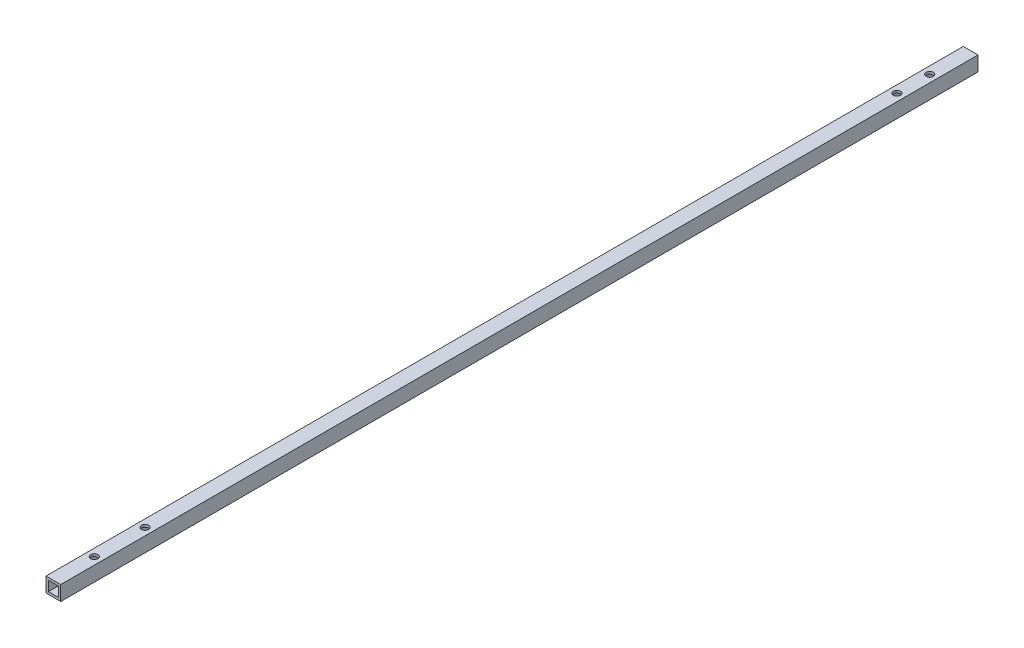
ISO-10303-21;
HEADER;
FILE_DESCRIPTION(('STEP AP214'),'2;1');
FILE_NAME('part.step','',(''),(''),'','','');
FILE_SCHEMA(('AUTOMOTIVE_DESIGN { 1 0 10303 214 1 1 1 1 }'));
ENDSEC;
DATA;
#1=APPLICATION_CONTEXT('core data for automotive mechanical design processes');
#2=APPLICATION_PROTOCOL_DEFINITION('international standard','automotive_design',2000,#1);
#3=PRODUCT_CONTEXT('',#1,'mechanical');
#4=PRODUCT('Part','Part','',(#3));
#5=PRODUCT_RELATED_PRODUCT_CATEGORY('part','',(#4));
#6=PRODUCT_DEFINITION_FORMATION('','',#4);
#7=PRODUCT_DEFINITION_CONTEXT('part definition',#1,'design');
#8=PRODUCT_DEFINITION('design','',#6,#7);
#9=PRODUCT_DEFINITION_SHAPE('','',#8);
#10=(LENGTH_UNIT() NAMED_UNIT(*) SI_UNIT(.MILLI.,.METRE.));
#11=(NAMED_UNIT(*) PLANE_ANGLE_UNIT() SI_UNIT($,.RADIAN.));
#12=(NAMED_UNIT(*) SI_UNIT($,.STERADIAN.) SOLID_ANGLE_UNIT());
#13=UNCERTAINTY_MEASURE_WITH_UNIT(LENGTH_MEASURE(1.E-05),#10,'distance_accuracy_value','');
#14=(GEOMETRIC_REPRESENTATION_CONTEXT(3) GLOBAL_UNCERTAINTY_ASSIGNED_CONTEXT((#13)) GLOBAL_UNIT_ASSIGNED_CONTEXT((#10,
#11,#12)) REPRESENTATION_CONTEXT('',''));
#15=CARTESIAN_POINT('',(0.,0.,0.));
#16=DIRECTION('',(0.,0.,1.));
#17=DIRECTION('',(1.,0.,0.));
#18=AXIS2_PLACEMENT_3D('',#15,#16,#17);
#19=CARTESIAN_POINT('',(4.5,4.5,560.3));
#20=DIRECTION('',(-1.,0.,0.));
#21=DIRECTION('',(0.,-1.,0.));
#22=AXIS2_PLACEMENT_3D('',#19,#20,#21);
#23=PLANE('',#22);
#24=DIRECTION('',(0.,1.,0.));
#25=VECTOR('',#24,1.);
#26=CARTESIAN_POINT('',(4.5,4.5,0.));
#27=LINE('',#26,#25);
#28=CARTESIAN_POINT('',(4.5,-4.5,0.));
#29=VERTEX_POINT('',#28);
#30=CARTESIAN_POINT('',(4.5,4.5,0.));
#31=VERTEX_POINT('',#30);
#32=EDGE_CURVE('E136',#29,#31,#27,.T.);
#33=ORIENTED_EDGE('',*,*,#32,.T.);
#34=DIRECTION('',(0.,0.,-1.));
#35=VECTOR('',#34,1.);
#36=CARTESIAN_POINT('',(4.5,4.5,560.3));
#37=LINE('',#36,#35);
#38=CARTESIAN_POINT('',(4.5,4.5,560.3));
#39=VERTEX_POINT('',#38);
#40=EDGE_CURVE('E12',#39,#31,#37,.T.);
#41=ORIENTED_EDGE('',*,*,#40,.F.);
#42=DIRECTION('',(0.,1.,0.));
#43=VECTOR('',#42,1.);
#44=CARTESIAN_POINT('',(4.5,4.5,560.3));
#45=LINE('',#44,#43);
#46=CARTESIAN_POINT('',(4.5,-4.5,560.3));
#47=VERTEX_POINT('',#46);
#48=EDGE_CURVE('E140',#47,#39,#45,.T.);
#49=ORIENTED_EDGE('',*,*,#48,.F.);
#50=DIRECTION('',(0.,0.,-1.));
#51=VECTOR('',#50,1.);
#52=CARTESIAN_POINT('',(4.5,-4.5,560.3));
#53=LINE('',#52,#51);
#54=EDGE_CURVE('E150',#47,#29,#53,.T.);
#55=ORIENTED_EDGE('',*,*,#54,.T.);
#56=EDGE_LOOP('',(#33,#41,#49,#55));
#57=FACE_BOUND('',#56,.T.);
#58=ADVANCED_FACE('F34',(#57),#23,.F.);
#59=CARTESIAN_POINT('',(-4.5,4.5,560.3));
#60=DIRECTION('',(0.,-1.,0.));
#61=DIRECTION('',(0.,0.,-1.));
#62=AXIS2_PLACEMENT_3D('',#59,#60,#61);
#63=PLANE('',#62);
#64=CARTESIAN_POINT('',(0.,4.5,504.3));
#65=DIRECTION('',(0.,1.,0.));
#66=DIRECTION('',(0.,0.,1.));
#67=AXIS2_PLACEMENT_3D('',#64,#65,#66);
#68=CIRCLE('',#67,2.19999999999996);
#69=CARTESIAN_POINT('',(0.,4.5,506.5));
#70=VERTEX_POINT('',#69);
#71=EDGE_CURVE('E177',#70,#70,#68,.T.);
#72=ORIENTED_EDGE('',*,*,#71,.F.);
#73=EDGE_LOOP('',(#72));
#74=FACE_BOUND('',#73,.T.);
#75=CARTESIAN_POINT('',(0.,4.5,535.3));
#76=DIRECTION('',(0.,1.,0.));
#77=DIRECTION('',(0.,0.,1.));
#78=AXIS2_PLACEMENT_3D('',#75,#76,#77);
#79=CIRCLE('',#78,2.19999999999996);
#80=CARTESIAN_POINT('',(0.,4.5,537.5));
#81=VERTEX_POINT('',#80);
#82=EDGE_CURVE('E184',#81,#81,#79,.T.);
#83=ORIENTED_EDGE('',*,*,#82,.F.);
#84=EDGE_LOOP('',(#83));
#85=FACE_BOUND('',#84,.T.);
#86=CARTESIAN_POINT('',(0.,4.5,25.));
#87=DIRECTION('',(0.,1.,0.));
#88=DIRECTION('',(0.,0.,1.));
#89=AXIS2_PLACEMENT_3D('',#86,#87,#88);
#90=CIRCLE('',#89,2.2);
#91=CARTESIAN_POINT('',(0.,4.5,27.2));
#92=VERTEX_POINT('',#91);
#93=EDGE_CURVE('E169',#92,#92,#90,.T.);
#94=ORIENTED_EDGE('',*,*,#93,.F.);
#95=EDGE_LOOP('',(#94));
#96=FACE_BOUND('',#95,.T.);
#97=CARTESIAN_POINT('',(0.,4.5,45.));
#98=DIRECTION('',(0.,1.,0.));
#99=DIRECTION('',(0.,0.,1.));
#100=AXIS2_PLACEMENT_3D('',#97,#98,#99);
#101=CIRCLE('',#100,2.2);
#102=CARTESIAN_POINT('',(0.,4.5,47.2));
#103=VERTEX_POINT('',#102);
#104=EDGE_CURVE('E199',#103,#103,#101,.T.);
#105=ORIENTED_EDGE('',*,*,#104,.F.);
#106=EDGE_LOOP('',(#105));
#107=FACE_BOUND('',#106,.T.);
#108=DIRECTION('',(-1.,0.,0.));
#109=VECTOR('',#108,1.);
#110=CARTESIAN_POINT('',(-4.5,4.5,0.));
#111=LINE('',#110,#109);
#112=CARTESIAN_POINT('',(-4.5,4.5,0.));
#113=VERTEX_POINT('',#112);
#114=EDGE_CURVE('E153',#31,#113,#111,.T.);
#115=ORIENTED_EDGE('',*,*,#114,.T.);
#116=DIRECTION('',(0.,0.,-1.));
#117=VECTOR('',#116,1.);
#118=CARTESIAN_POINT('',(-4.5,4.5,560.3));
#119=LINE('',#118,#117);
#120=CARTESIAN_POINT('',(-4.5,4.5,560.3));
#121=VERTEX_POINT('',#120);
#122=EDGE_CURVE('E42',#121,#113,#119,.T.);
#123=ORIENTED_EDGE('',*,*,#122,.F.);
#124=DIRECTION('',(-1.,0.,0.));
#125=VECTOR('',#124,1.);
#126=CARTESIAN_POINT('',(-4.5,4.5,560.3));
#127=LINE('',#126,#125);
#128=EDGE_CURVE('E143',#39,#121,#127,.T.);
#129=ORIENTED_EDGE('',*,*,#128,.F.);
#130=ORIENTED_EDGE('',*,*,#40,.T.);
#131=EDGE_LOOP('',(#115,#123,#129,#130));
#132=FACE_BOUND('',#131,.T.);
#133=ADVANCED_FACE('F237',(#74,#85,#96,#107,#132),#63,.F.);
#134=CARTESIAN_POINT('',(-4.5,4.5,560.3));
#135=DIRECTION('',(1.,0.,0.));
#136=DIRECTION('',(0.,1.,0.));
#137=AXIS2_PLACEMENT_3D('',#134,#135,#136);
#138=PLANE('',#137);
#139=DIRECTION('',(0.,-1.,0.));
#140=VECTOR('',#139,1.);
#141=CARTESIAN_POINT('',(-4.5,4.5,0.));
#142=LINE('',#141,#140);
#143=CARTESIAN_POINT('',(-4.5,-4.5,0.));
#144=VERTEX_POINT('',#143);
#145=EDGE_CURVE('E155',#113,#144,#142,.T.);
#146=ORIENTED_EDGE('',*,*,#145,.T.);
#147=DIRECTION('',(0.,0.,-1.));
#148=VECTOR('',#147,1.);
#149=CARTESIAN_POINT('',(-4.5,-4.5,560.3));
#150=LINE('',#149,#148);
#151=CARTESIAN_POINT('',(-4.5,-4.5,560.3));
#152=VERTEX_POINT('',#151);
#153=EDGE_CURVE('E160',#152,#144,#150,.T.);
#154=ORIENTED_EDGE('',*,*,#153,.F.);
#155=DIRECTION('',(0.,-1.,0.));
#156=VECTOR('',#155,1.);
#157=CARTESIAN_POINT('',(-4.5,4.5,560.3));
#158=LINE('',#157,#156);
#159=EDGE_CURVE('E146',#121,#152,#158,.T.);
#160=ORIENTED_EDGE('',*,*,#159,.F.);
#161=ORIENTED_EDGE('',*,*,#122,.T.);
#162=EDGE_LOOP('',(#146,#154,#160,#161));
#163=FACE_BOUND('',#162,.T.);
#164=ADVANCED_FACE('F242',(#163),#138,.F.);
#165=CARTESIAN_POINT('',(-4.5,-4.5,560.3));
#166=DIRECTION('',(0.,1.,0.));
#167=DIRECTION('',(0.,0.,1.));
#168=AXIS2_PLACEMENT_3D('',#165,#166,#167);
#169=PLANE('',#168);
#170=CARTESIAN_POINT('',(0.,-4.5,504.3));
#171=DIRECTION('',(0.,1.,0.));
#172=DIRECTION('',(0.,0.,1.));
#173=AXIS2_PLACEMENT_3D('',#170,#171,#172);
#174=CIRCLE('',#173,2.19999999999996);
#175=CARTESIAN_POINT('',(0.,-4.5,506.5));
#176=VERTEX_POINT('',#175);
#177=EDGE_CURVE('E196',#176,#176,#174,.T.);
#178=ORIENTED_EDGE('',*,*,#177,.T.);
#179=EDGE_LOOP('',(#178));
#180=FACE_BOUND('',#179,.T.);
#181=CARTESIAN_POINT('',(0.,-4.5,535.3));
#182=DIRECTION('',(0.,1.,0.));
#183=DIRECTION('',(0.,0.,1.));
#184=AXIS2_PLACEMENT_3D('',#181,#182,#183);
#185=CIRCLE('',#184,2.19999999999996);
#186=CARTESIAN_POINT('',(0.,-4.5,537.5));
#187=VERTEX_POINT('',#186);
#188=EDGE_CURVE('E181',#187,#187,#185,.T.);
#189=ORIENTED_EDGE('',*,*,#188,.T.);
#190=EDGE_LOOP('',(#189));
#191=FACE_BOUND('',#190,.T.);
#192=CARTESIAN_POINT('',(0.,-4.49999999999995,25.));
#193=DIRECTION('',(0.,1.,0.));
#194=DIRECTION('',(0.,0.,1.));
#195=AXIS2_PLACEMENT_3D('',#192,#193,#194);
#196=CIRCLE('',#195,2.2);
#197=CARTESIAN_POINT('',(0.,-4.49999999999995,27.2));
#198=VERTEX_POINT('',#197);
#199=EDGE_CURVE('E124',#198,#198,#196,.T.);
#200=ORIENTED_EDGE('',*,*,#199,.T.);
#201=EDGE_LOOP('',(#200));
#202=FACE_BOUND('',#201,.T.);
#203=CARTESIAN_POINT('',(0.,-4.49999999999995,45.));
#204=DIRECTION('',(0.,1.,0.));
#205=DIRECTION('',(0.,0.,1.));
#206=AXIS2_PLACEMENT_3D('',#203,#204,#205);
#207=CIRCLE('',#206,2.2);
#208=CARTESIAN_POINT('',(0.,-4.49999999999995,47.2));
#209=VERTEX_POINT('',#208);
#210=EDGE_CURVE('E173',#209,#209,#207,.T.);
#211=ORIENTED_EDGE('',*,*,#210,.T.);
#212=EDGE_LOOP('',(#211));
#213=FACE_BOUND('',#212,.T.);
#214=DIRECTION('',(1.,0.,0.));
#215=VECTOR('',#214,1.);
#216=CARTESIAN_POINT('',(-4.5,-4.5,0.));
#217=LINE('',#216,#215);
#218=EDGE_CURVE('E144',#144,#29,#217,.T.);
#219=ORIENTED_EDGE('',*,*,#218,.T.);
#220=ORIENTED_EDGE('',*,*,#54,.F.);
#221=DIRECTION('',(1.,0.,0.));
#222=VECTOR('',#221,1.);
#223=CARTESIAN_POINT('',(-4.5,-4.5,560.3));
#224=LINE('',#223,#222);
#225=EDGE_CURVE('E148',#152,#47,#224,.T.);
#226=ORIENTED_EDGE('',*,*,#225,.F.);
#227=ORIENTED_EDGE('',*,*,#153,.T.);
#228=EDGE_LOOP('',(#219,#220,#226,#227));
#229=FACE_BOUND('',#228,.T.);
#230=ADVANCED_FACE('F213',(#180,#191,#202,#213,#229),#169,.F.);
#231=CARTESIAN_POINT('',(0.,0.,560.3));
#232=DIRECTION('',(0.,0.,1.));
#233=DIRECTION('',(1.,0.,0.));
#234=AXIS2_PLACEMENT_3D('',#231,#232,#233);
#235=PLANE('',#234);
#236=DIRECTION('',(0.,1.,0.));
#237=VECTOR('',#236,1.);
#238=CARTESIAN_POINT('',(3.,3.,560.3));
#239=LINE('',#238,#237);
#240=CARTESIAN_POINT('',(3.,-3.,560.3));
#241=VERTEX_POINT('',#240);
#242=CARTESIAN_POINT('',(3.,3.,560.3));
#243=VERTEX_POINT('',#242);
#244=EDGE_CURVE('E50',#241,#243,#239,.T.);
#245=ORIENTED_EDGE('',*,*,#244,.F.);
#246=DIRECTION('',(1.,0.,0.));
#247=VECTOR('',#246,1.);
#248=CARTESIAN_POINT('',(-3.,-3.,560.3));
#249=LINE('',#248,#247);
#250=CARTESIAN_POINT('',(-3.,-3.,560.3));
#251=VERTEX_POINT('',#250);
#252=EDGE_CURVE('E118',#251,#241,#249,.T.);
#253=ORIENTED_EDGE('',*,*,#252,.F.);
#254=DIRECTION('',(0.,-1.,0.));
#255=VECTOR('',#254,1.);
#256=CARTESIAN_POINT('',(-3.,3.,560.3));
#257=LINE('',#256,#255);
#258=CARTESIAN_POINT('',(-3.,3.,560.3));
#259=VERTEX_POINT('',#258);
#260=EDGE_CURVE('E121',#259,#251,#257,.T.);
#261=ORIENTED_EDGE('',*,*,#260,.F.);
#262=DIRECTION('',(-1.,0.,0.));
#263=VECTOR('',#262,1.);
#264=CARTESIAN_POINT('',(-3.,3.,560.3));
#265=LINE('',#264,#263);
#266=EDGE_CURVE('E130',#243,#259,#265,.T.);
#267=ORIENTED_EDGE('',*,*,#266,.F.);
#268=EDGE_LOOP('',(#245,#253,#261,#267));
#269=FACE_BOUND('',#268,.T.);
#270=ORIENTED_EDGE('',*,*,#48,.T.);
#271=ORIENTED_EDGE('',*,*,#128,.T.);
#272=ORIENTED_EDGE('',*,*,#159,.T.);
#273=ORIENTED_EDGE('',*,*,#225,.T.);
#274=EDGE_LOOP('',(#270,#271,#272,#273));
#275=FACE_BOUND('',#274,.T.);
#276=ADVANCED_FACE('F254',(#269,#275),#235,.T.);
#277=CARTESIAN_POINT('',(0.,0.,0.));
#278=DIRECTION('',(0.,0.,1.));
#279=DIRECTION('',(1.,0.,0.));
#280=AXIS2_PLACEMENT_3D('',#277,#278,#279);
#281=PLANE('',#280);
#282=DIRECTION('',(1.,0.,0.));
#283=VECTOR('',#282,1.);
#284=CARTESIAN_POINT('',(-3.,-3.,0.));
#285=LINE('',#284,#283);
#286=CARTESIAN_POINT('',(-3.,-3.,0.));
#287=VERTEX_POINT('',#286);
#288=CARTESIAN_POINT('',(3.,-3.,0.));
#289=VERTEX_POINT('',#288);
#290=EDGE_CURVE('E108',#287,#289,#285,.T.);
#291=ORIENTED_EDGE('',*,*,#290,.T.);
#292=DIRECTION('',(0.,1.,0.));
#293=VECTOR('',#292,1.);
#294=CARTESIAN_POINT('',(3.,3.,0.));
#295=LINE('',#294,#293);
#296=CARTESIAN_POINT('',(3.,3.,0.));
#297=VERTEX_POINT('',#296);
#298=EDGE_CURVE('E102',#289,#297,#295,.T.);
#299=ORIENTED_EDGE('',*,*,#298,.T.);
#300=DIRECTION('',(-1.,0.,0.));
#301=VECTOR('',#300,1.);
#302=CARTESIAN_POINT('',(-3.,3.,0.));
#303=LINE('',#302,#301);
#304=CARTESIAN_POINT('',(-3.,3.,0.));
#305=VERTEX_POINT('',#304);
#306=EDGE_CURVE('E111',#297,#305,#303,.T.);
#307=ORIENTED_EDGE('',*,*,#306,.T.);
#308=DIRECTION('',(0.,-1.,0.));
#309=VECTOR('',#308,1.);
#310=CARTESIAN_POINT('',(-3.,3.,0.));
#311=LINE('',#310,#309);
#312=EDGE_CURVE('E58',#305,#287,#311,.T.);
#313=ORIENTED_EDGE('',*,*,#312,.T.);
#314=EDGE_LOOP('',(#291,#299,#307,#313));
#315=FACE_BOUND('',#314,.T.);
#316=ORIENTED_EDGE('',*,*,#32,.F.);
#317=ORIENTED_EDGE('',*,*,#218,.F.);
#318=ORIENTED_EDGE('',*,*,#145,.F.);
#319=ORIENTED_EDGE('',*,*,#114,.F.);
#320=EDGE_LOOP('',(#316,#317,#318,#319));
#321=FACE_BOUND('',#320,.T.);
#322=ADVANCED_FACE('F115',(#315,#321),#281,.F.);
#323=CARTESIAN_POINT('',(3.,3.,0.));
#324=DIRECTION('',(1.,0.,0.));
#325=DIRECTION('',(0.,1.,0.));
#326=AXIS2_PLACEMENT_3D('',#323,#324,#325);
#327=PLANE('',#326);
#328=ORIENTED_EDGE('',*,*,#244,.T.);
#329=DIRECTION('',(0.,0.,1.));
#330=VECTOR('',#329,1.);
#331=CARTESIAN_POINT('',(3.,3.,0.));
#332=LINE('',#331,#330);
#333=EDGE_CURVE('E98',#297,#243,#332,.T.);
#334=ORIENTED_EDGE('',*,*,#333,.F.);
#335=ORIENTED_EDGE('',*,*,#298,.F.);
#336=DIRECTION('',(0.,0.,1.));
#337=VECTOR('',#336,1.);
#338=CARTESIAN_POINT('',(3.,-3.,0.));
#339=LINE('',#338,#337);
#340=EDGE_CURVE('E134',#289,#241,#339,.T.);
#341=ORIENTED_EDGE('',*,*,#340,.T.);
#342=EDGE_LOOP('',(#328,#334,#335,#341));
#343=FACE_BOUND('',#342,.T.);
#344=ADVANCED_FACE('F100',(#343),#327,.F.);
#345=CARTESIAN_POINT('',(-3.,-3.,0.));
#346=DIRECTION('',(0.,-1.,0.));
#347=DIRECTION('',(0.,0.,-1.));
#348=AXIS2_PLACEMENT_3D('',#345,#346,#347);
#349=PLANE('',#348);
#350=CARTESIAN_POINT('',(0.,-3.,504.3));
#351=DIRECTION('',(0.,-1.,0.));
#352=DIRECTION('',(0.,0.,-1.));
#353=AXIS2_PLACEMENT_3D('',#350,#351,#352);
#354=CIRCLE('',#353,2.19999999999996);
#355=CARTESIAN_POINT('',(0.,-3.,502.1));
#356=VERTEX_POINT('',#355);
#357=EDGE_CURVE('E193',#356,#356,#354,.T.);
#358=ORIENTED_EDGE('',*,*,#357,.T.);
#359=EDGE_LOOP('',(#358));
#360=FACE_BOUND('',#359,.T.);
#361=CARTESIAN_POINT('',(0.,-3.,535.3));
#362=DIRECTION('',(0.,-1.,0.));
#363=DIRECTION('',(0.,0.,-1.));
#364=AXIS2_PLACEMENT_3D('',#361,#362,#363);
#365=CIRCLE('',#364,2.19999999999996);
#366=CARTESIAN_POINT('',(0.,-3.,533.1));
#367=VERTEX_POINT('',#366);
#368=EDGE_CURVE('E176',#367,#367,#365,.T.);
#369=ORIENTED_EDGE('',*,*,#368,.T.);
#370=EDGE_LOOP('',(#369));
#371=FACE_BOUND('',#370,.T.);
#372=CARTESIAN_POINT('',(0.,-3.,25.));
#373=DIRECTION('',(0.,-1.,0.));
#374=DIRECTION('',(0.,0.,-1.));
#375=AXIS2_PLACEMENT_3D('',#372,#373,#374);
#376=CIRCLE('',#375,2.2);
#377=CARTESIAN_POINT('',(0.,-3.,22.8));
#378=VERTEX_POINT('',#377);
#379=EDGE_CURVE('E172',#378,#378,#376,.T.);
#380=ORIENTED_EDGE('',*,*,#379,.T.);
#381=EDGE_LOOP('',(#380));
#382=FACE_BOUND('',#381,.T.);
#383=CARTESIAN_POINT('',(0.,-3.,45.));
#384=DIRECTION('',(0.,-1.,0.));
#385=DIRECTION('',(0.,0.,-1.));
#386=AXIS2_PLACEMENT_3D('',#383,#384,#385);
#387=CIRCLE('',#386,2.2);
#388=CARTESIAN_POINT('',(0.,-3.,42.8));
#389=VERTEX_POINT('',#388);
#390=EDGE_CURVE('E168',#389,#389,#387,.T.);
#391=ORIENTED_EDGE('',*,*,#390,.T.);
#392=EDGE_LOOP('',(#391));
#393=FACE_BOUND('',#392,.T.);
#394=ORIENTED_EDGE('',*,*,#252,.T.);
#395=ORIENTED_EDGE('',*,*,#340,.F.);
#396=ORIENTED_EDGE('',*,*,#290,.F.);
#397=DIRECTION('',(0.,0.,1.));
#398=VECTOR('',#397,1.);
#399=CARTESIAN_POINT('',(-3.,-3.,0.));
#400=LINE('',#399,#398);
#401=EDGE_CURVE('E137',#287,#251,#400,.T.);
#402=ORIENTED_EDGE('',*,*,#401,.T.);
#403=EDGE_LOOP('',(#394,#395,#396,#402));
#404=FACE_BOUND('',#403,.T.);
#405=ADVANCED_FACE('F274',(#360,#371,#382,#393,#404),#349,.F.);
#406=CARTESIAN_POINT('',(-3.,3.,0.));
#407=DIRECTION('',(-1.,0.,0.));
#408=DIRECTION('',(0.,-1.,0.));
#409=AXIS2_PLACEMENT_3D('',#406,#407,#408);
#410=PLANE('',#409);
#411=ORIENTED_EDGE('',*,*,#260,.T.);
#412=ORIENTED_EDGE('',*,*,#401,.F.);
#413=ORIENTED_EDGE('',*,*,#312,.F.);
#414=DIRECTION('',(0.,0.,1.));
#415=VECTOR('',#414,1.);
#416=CARTESIAN_POINT('',(-3.,3.,0.));
#417=LINE('',#416,#415);
#418=EDGE_CURVE('E107',#305,#259,#417,.T.);
#419=ORIENTED_EDGE('',*,*,#418,.T.);
#420=EDGE_LOOP('',(#411,#412,#413,#419));
#421=FACE_BOUND('',#420,.T.);
#422=ADVANCED_FACE('F277',(#421),#410,.F.);
#423=CARTESIAN_POINT('',(-3.,3.,0.));
#424=DIRECTION('',(0.,1.,0.));
#425=DIRECTION('',(0.,0.,1.));
#426=AXIS2_PLACEMENT_3D('',#423,#424,#425);
#427=PLANE('',#426);
#428=CARTESIAN_POINT('',(0.,3.,504.3));
#429=DIRECTION('',(0.,1.,0.));
#430=DIRECTION('',(0.,0.,1.));
#431=AXIS2_PLACEMENT_3D('',#428,#429,#430);
#432=CIRCLE('',#431,2.19999999999996);
#433=CARTESIAN_POINT('',(0.,3.,506.5));
#434=VERTEX_POINT('',#433);
#435=EDGE_CURVE('E37',#434,#434,#432,.T.);
#436=ORIENTED_EDGE('',*,*,#435,.T.);
#437=EDGE_LOOP('',(#436));
#438=FACE_BOUND('',#437,.T.);
#439=CARTESIAN_POINT('',(0.,3.,535.3));
#440=DIRECTION('',(0.,1.,0.));
#441=DIRECTION('',(0.,0.,1.));
#442=AXIS2_PLACEMENT_3D('',#439,#440,#441);
#443=CIRCLE('',#442,2.19999999999996);
#444=CARTESIAN_POINT('',(0.,3.,537.5));
#445=VERTEX_POINT('',#444);
#446=EDGE_CURVE('E174',#445,#445,#443,.T.);
#447=ORIENTED_EDGE('',*,*,#446,.T.);
#448=EDGE_LOOP('',(#447));
#449=FACE_BOUND('',#448,.T.);
#450=CARTESIAN_POINT('',(0.,3.,25.));
#451=DIRECTION('',(0.,1.,0.));
#452=DIRECTION('',(0.,0.,1.));
#453=AXIS2_PLACEMENT_3D('',#450,#451,#452);
#454=CIRCLE('',#453,2.2);
#455=CARTESIAN_POINT('',(0.,3.,27.2));
#456=VERTEX_POINT('',#455);
#457=EDGE_CURVE('E170',#456,#456,#454,.T.);
#458=ORIENTED_EDGE('',*,*,#457,.T.);
#459=EDGE_LOOP('',(#458));
#460=FACE_BOUND('',#459,.T.);
#461=CARTESIAN_POINT('',(0.,3.,45.));
#462=DIRECTION('',(0.,1.,0.));
#463=DIRECTION('',(0.,0.,1.));
#464=AXIS2_PLACEMENT_3D('',#461,#462,#463);
#465=CIRCLE('',#464,2.2);
#466=CARTESIAN_POINT('',(0.,3.,47.2));
#467=VERTEX_POINT('',#466);
#468=EDGE_CURVE('E165',#467,#467,#465,.T.);
#469=ORIENTED_EDGE('',*,*,#468,.T.);
#470=EDGE_LOOP('',(#469));
#471=FACE_BOUND('',#470,.T.);
#472=ORIENTED_EDGE('',*,*,#266,.T.);
#473=ORIENTED_EDGE('',*,*,#418,.F.);
#474=ORIENTED_EDGE('',*,*,#306,.F.);
#475=ORIENTED_EDGE('',*,*,#333,.T.);
#476=EDGE_LOOP('',(#472,#473,#474,#475));
#477=FACE_BOUND('',#476,.T.);
#478=ADVANCED_FACE('F112',(#438,#449,#460,#471,#477),#427,.F.);
#479=CARTESIAN_POINT('',(0.,-577.5,45.));
#480=DIRECTION('',(0.,1.,0.));
#481=DIRECTION('',(0.,0.,1.));
#482=AXIS2_PLACEMENT_3D('',#479,#480,#481);
#483=CYLINDRICAL_SURFACE('',#482,2.2);
#484=ORIENTED_EDGE('',*,*,#104,.T.);
#485=EDGE_LOOP('',(#484));
#486=FACE_BOUND('',#485,.T.);
#487=ORIENTED_EDGE('',*,*,#468,.F.);
#488=EDGE_LOOP('',(#487));
#489=FACE_BOUND('',#488,.T.);
#490=ADVANCED_FACE('F233',(#486,#489),#483,.F.);
#491=CARTESIAN_POINT('',(0.,-577.5,25.));
#492=DIRECTION('',(0.,1.,0.));
#493=DIRECTION('',(0.,0.,1.));
#494=AXIS2_PLACEMENT_3D('',#491,#492,#493);
#495=CYLINDRICAL_SURFACE('',#494,2.2);
#496=ORIENTED_EDGE('',*,*,#93,.T.);
#497=EDGE_LOOP('',(#496));
#498=FACE_BOUND('',#497,.T.);
#499=ORIENTED_EDGE('',*,*,#457,.F.);
#500=EDGE_LOOP('',(#499));
#501=FACE_BOUND('',#500,.T.);
#502=ADVANCED_FACE('F222',(#498,#501),#495,.F.);
#503=ORIENTED_EDGE('',*,*,#390,.F.);
#504=EDGE_LOOP('',(#503));
#505=FACE_BOUND('',#504,.T.);
#506=ORIENTED_EDGE('',*,*,#210,.F.);
#507=EDGE_LOOP('',(#506));
#508=FACE_BOUND('',#507,.T.);
#509=ADVANCED_FACE('F219',(#505,#508),#483,.F.);
#510=ORIENTED_EDGE('',*,*,#379,.F.);
#511=EDGE_LOOP('',(#510));
#512=FACE_BOUND('',#511,.T.);
#513=ORIENTED_EDGE('',*,*,#199,.F.);
#514=EDGE_LOOP('',(#513));
#515=FACE_BOUND('',#514,.T.);
#516=ADVANCED_FACE('F216',(#512,#515),#495,.F.);
#517=CARTESIAN_POINT('',(0.,-15.5,535.3));
#518=DIRECTION('',(0.,1.,0.));
#519=DIRECTION('',(0.,0.,1.));
#520=AXIS2_PLACEMENT_3D('',#517,#518,#519);
#521=CYLINDRICAL_SURFACE('',#520,2.19999999999996);
#522=ORIENTED_EDGE('',*,*,#82,.T.);
#523=EDGE_LOOP('',(#522));
#524=FACE_BOUND('',#523,.T.);
#525=ORIENTED_EDGE('',*,*,#446,.F.);
#526=EDGE_LOOP('',(#525));
#527=FACE_BOUND('',#526,.T.);
#528=ADVANCED_FACE('F218',(#524,#527),#521,.F.);
#529=CARTESIAN_POINT('',(0.,-15.5,504.3));
#530=DIRECTION('',(0.,1.,0.));
#531=DIRECTION('',(0.,0.,1.));
#532=AXIS2_PLACEMENT_3D('',#529,#530,#531);
#533=CYLINDRICAL_SURFACE('',#532,2.19999999999996);
#534=ORIENTED_EDGE('',*,*,#71,.T.);
#535=EDGE_LOOP('',(#534));
#536=FACE_BOUND('',#535,.T.);
#537=ORIENTED_EDGE('',*,*,#435,.F.);
#538=EDGE_LOOP('',(#537));
#539=FACE_BOUND('',#538,.T.);
#540=ADVANCED_FACE('F227',(#536,#539),#533,.F.);
#541=ORIENTED_EDGE('',*,*,#368,.F.);
#542=EDGE_LOOP('',(#541));
#543=FACE_BOUND('',#542,.T.);
#544=ORIENTED_EDGE('',*,*,#188,.F.);
#545=EDGE_LOOP('',(#544));
#546=FACE_BOUND('',#545,.T.);
#547=ADVANCED_FACE('F230',(#543,#546),#521,.F.);
#548=ORIENTED_EDGE('',*,*,#357,.F.);
#549=EDGE_LOOP('',(#548));
#550=FACE_BOUND('',#549,.T.);
#551=ORIENTED_EDGE('',*,*,#177,.F.);
#552=EDGE_LOOP('',(#551));
#553=FACE_BOUND('',#552,.T.);
#554=ADVANCED_FACE('F298',(#550,#553),#533,.F.);
#555=CLOSED_SHELL('',(#58,#133,#164,#230,#276,#322,#344,#405,#422,#478,#490,#502,#509,#516,#528,
#540,#547,#554));
#556=MANIFOLD_SOLID_BREP('B2',#555);
#557=ADVANCED_BREP_SHAPE_REPRESENTATION('',(#18,#556),#14);
#558=SHAPE_DEFINITION_REPRESENTATION(#9,#557);
ENDSEC;
END-ISO-10303-21;
